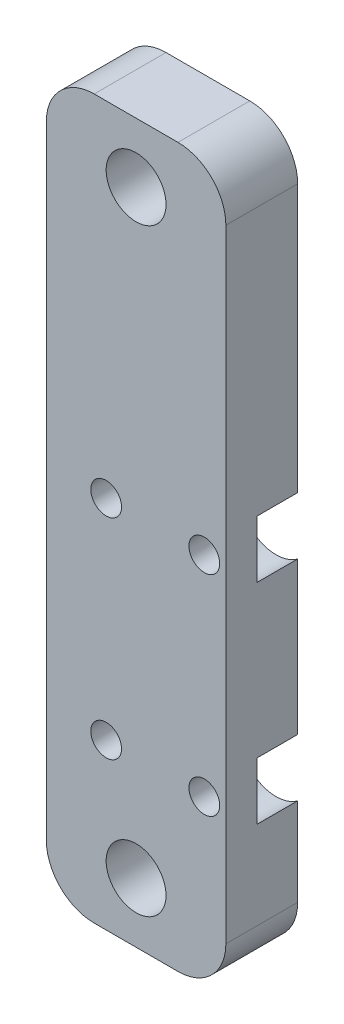
ISO-10303-21;
HEADER;
FILE_DESCRIPTION(('STEP AP214'),'2;1');
FILE_NAME('part.step','',(''),(''),'','','');
FILE_SCHEMA(('AUTOMOTIVE_DESIGN { 1 0 10303 214 1 1 1 1 }'));
ENDSEC;
DATA;
#1=APPLICATION_CONTEXT('core data for automotive mechanical design processes');
#2=APPLICATION_PROTOCOL_DEFINITION('international standard','automotive_design',2000,#1);
#3=PRODUCT_CONTEXT('',#1,'mechanical');
#4=PRODUCT('Part','Part','',(#3));
#5=PRODUCT_RELATED_PRODUCT_CATEGORY('part','',(#4));
#6=PRODUCT_DEFINITION_FORMATION('','',#4);
#7=PRODUCT_DEFINITION_CONTEXT('part definition',#1,'design');
#8=PRODUCT_DEFINITION('design','',#6,#7);
#9=PRODUCT_DEFINITION_SHAPE('','',#8);
#10=(LENGTH_UNIT() NAMED_UNIT(*) SI_UNIT(.MILLI.,.METRE.));
#11=(NAMED_UNIT(*) PLANE_ANGLE_UNIT() SI_UNIT($,.RADIAN.));
#12=(NAMED_UNIT(*) SI_UNIT($,.STERADIAN.) SOLID_ANGLE_UNIT());
#13=UNCERTAINTY_MEASURE_WITH_UNIT(LENGTH_MEASURE(1.E-05),#10,'distance_accuracy_value','');
#14=(GEOMETRIC_REPRESENTATION_CONTEXT(3) GLOBAL_UNCERTAINTY_ASSIGNED_CONTEXT((#13)) GLOBAL_UNIT_ASSIGNED_CONTEXT((#10,
#11,#12)) REPRESENTATION_CONTEXT('',''));
#15=CARTESIAN_POINT('',(0.,0.,0.));
#16=DIRECTION('',(0.,0.,1.));
#17=DIRECTION('',(1.,0.,0.));
#18=AXIS2_PLACEMENT_3D('',#15,#16,#17);
#19=CARTESIAN_POINT('',(0.,0.,7.62));
#20=DIRECTION('',(0.,0.,1.));
#21=DIRECTION('',(1.,0.,0.));
#22=AXIS2_PLACEMENT_3D('',#19,#20,#21);
#23=PLANE('',#22);
#24=CARTESIAN_POINT('',(-7.62000000000001,-7.93750000000001,7.62));
#25=DIRECTION('',(0.,0.,-1.));
#26=DIRECTION('',(-1.,0.,0.));
#27=AXIS2_PLACEMENT_3D('',#24,#25,#26);
#28=CIRCLE('',#27,1.63195000000001);
#29=CARTESIAN_POINT('',(-9.25195000000001,-7.93750000000001,7.62));
#30=VERTEX_POINT('',#29);
#31=EDGE_CURVE('E384',#30,#30,#28,.T.);
#32=ORIENTED_EDGE('',*,*,#31,.T.);
#33=EDGE_LOOP('',(#32));
#34=FACE_BOUND('',#33,.T.);
#35=CARTESIAN_POINT('',(-7.62000000000001,-30.1625,7.62));
#36=DIRECTION('',(0.,0.,-1.));
#37=DIRECTION('',(-1.,0.,0.));
#38=AXIS2_PLACEMENT_3D('',#35,#36,#37);
#39=CIRCLE('',#38,1.63195000000001);
#40=CARTESIAN_POINT('',(-9.25195000000001,-30.1625,7.62));
#41=VERTEX_POINT('',#40);
#42=EDGE_CURVE('E372',#41,#41,#39,.T.);
#43=ORIENTED_EDGE('',*,*,#42,.T.);
#44=EDGE_LOOP('',(#43));
#45=FACE_BOUND('',#44,.T.);
#46=DIRECTION('',(0.,1.,0.));
#47=VECTOR('',#46,1.);
#48=CARTESIAN_POINT('',(5.08,28.575,7.62));
#49=LINE('',#48,#47);
#50=CARTESIAN_POINT('',(5.08,-42.545,7.62));
#51=VERTEX_POINT('',#50);
#52=CARTESIAN_POINT('',(5.08,23.495,7.62));
#53=VERTEX_POINT('',#52);
#54=EDGE_CURVE('E250',#51,#53,#49,.T.);
#55=ORIENTED_EDGE('',*,*,#54,.T.);
#56=CARTESIAN_POINT('',(0.,23.495,7.62));
#57=DIRECTION('',(0.,0.,1.));
#58=DIRECTION('',(1.,0.,0.));
#59=AXIS2_PLACEMENT_3D('',#56,#57,#58);
#60=CIRCLE('',#59,5.08);
#61=CARTESIAN_POINT('',(0.,28.575,7.62));
#62=VERTEX_POINT('',#61);
#63=EDGE_CURVE('E172',#53,#62,#60,.T.);
#64=ORIENTED_EDGE('',*,*,#63,.T.);
#65=DIRECTION('',(-1.,0.,0.));
#66=VECTOR('',#65,1.);
#67=CARTESIAN_POINT('',(-13.97,28.575,7.62));
#68=LINE('',#67,#66);
#69=CARTESIAN_POINT('',(-8.89000000000001,28.575,7.62));
#70=VERTEX_POINT('',#69);
#71=EDGE_CURVE('E203',#62,#70,#68,.T.);
#72=ORIENTED_EDGE('',*,*,#71,.T.);
#73=CARTESIAN_POINT('',(-8.89000000000001,23.495,7.62));
#74=DIRECTION('',(0.,0.,1.));
#75=DIRECTION('',(1.,0.,0.));
#76=AXIS2_PLACEMENT_3D('',#73,#74,#75);
#77=CIRCLE('',#76,5.08);
#78=CARTESIAN_POINT('',(-13.97,23.495,7.62));
#79=VERTEX_POINT('',#78);
#80=EDGE_CURVE('E167',#70,#79,#77,.T.);
#81=ORIENTED_EDGE('',*,*,#80,.T.);
#82=DIRECTION('',(0.,-1.,0.));
#83=VECTOR('',#82,1.);
#84=CARTESIAN_POINT('',(-13.97,28.575,7.62));
#85=LINE('',#84,#83);
#86=CARTESIAN_POINT('',(-13.97,-42.545,7.62));
#87=VERTEX_POINT('',#86);
#88=EDGE_CURVE('E186',#79,#87,#85,.T.);
#89=ORIENTED_EDGE('',*,*,#88,.T.);
#90=CARTESIAN_POINT('',(-8.89,-42.545,7.62));
#91=DIRECTION('',(0.,0.,1.));
#92=DIRECTION('',(1.,0.,0.));
#93=AXIS2_PLACEMENT_3D('',#90,#91,#92);
#94=CIRCLE('',#93,5.08);
#95=CARTESIAN_POINT('',(-8.89,-47.625,7.62));
#96=VERTEX_POINT('',#95);
#97=EDGE_CURVE('E56',#87,#96,#94,.T.);
#98=ORIENTED_EDGE('',*,*,#97,.T.);
#99=DIRECTION('',(1.,0.,0.));
#100=VECTOR('',#99,1.);
#101=CARTESIAN_POINT('',(-13.97,-47.625,7.62));
#102=LINE('',#101,#100);
#103=CARTESIAN_POINT('',(0.,-47.625,7.62));
#104=VERTEX_POINT('',#103);
#105=EDGE_CURVE('E249',#96,#104,#102,.T.);
#106=ORIENTED_EDGE('',*,*,#105,.T.);
#107=CARTESIAN_POINT('',(0.,-42.545,7.62));
#108=DIRECTION('',(0.,0.,1.));
#109=DIRECTION('',(1.,0.,0.));
#110=AXIS2_PLACEMENT_3D('',#107,#108,#109);
#111=CIRCLE('',#110,5.08);
#112=EDGE_CURVE('E170',#104,#51,#111,.T.);
#113=ORIENTED_EDGE('',*,*,#112,.T.);
#114=EDGE_LOOP('',(#55,#64,#72,#81,#89,#98,#106,#113));
#115=FACE_BOUND('',#114,.T.);
#116=CARTESIAN_POINT('',(-4.44499999999999,-41.275,7.62));
#117=DIRECTION('',(0.,0.,1.));
#118=DIRECTION('',(1.,0.,0.));
#119=AXIS2_PLACEMENT_3D('',#116,#117,#118);
#120=CIRCLE('',#119,3.175);
#121=CARTESIAN_POINT('',(-1.26999999999999,-41.275,7.62));
#122=VERTEX_POINT('',#121);
#123=EDGE_CURVE('E200',#122,#122,#120,.T.);
#124=ORIENTED_EDGE('',*,*,#123,.F.);
#125=EDGE_LOOP('',(#124));
#126=FACE_BOUND('',#125,.T.);
#127=CARTESIAN_POINT('',(-4.445,22.225,7.62));
#128=DIRECTION('',(0.,0.,1.));
#129=DIRECTION('',(1.,0.,0.));
#130=AXIS2_PLACEMENT_3D('',#127,#128,#129);
#131=CIRCLE('',#130,3.175);
#132=CARTESIAN_POINT('',(-1.27,22.225,7.62));
#133=VERTEX_POINT('',#132);
#134=EDGE_CURVE('E214',#133,#133,#131,.T.);
#135=ORIENTED_EDGE('',*,*,#134,.F.);
#136=EDGE_LOOP('',(#135));
#137=FACE_BOUND('',#136,.T.);
#138=CARTESIAN_POINT('',(2.79399999999999,-7.93750000000001,7.62));
#139=DIRECTION('',(0.,0.,-1.));
#140=DIRECTION('',(-1.,0.,0.));
#141=AXIS2_PLACEMENT_3D('',#138,#139,#140);
#142=CIRCLE('',#141,1.63195000000001);
#143=CARTESIAN_POINT('',(1.16204999999998,-7.93750000000001,7.62));
#144=VERTEX_POINT('',#143);
#145=EDGE_CURVE('E236',#144,#144,#142,.T.);
#146=ORIENTED_EDGE('',*,*,#145,.T.);
#147=EDGE_LOOP('',(#146));
#148=FACE_BOUND('',#147,.T.);
#149=CARTESIAN_POINT('',(2.79399999999999,-30.1625,7.62));
#150=DIRECTION('',(0.,0.,-1.));
#151=DIRECTION('',(-1.,0.,0.));
#152=AXIS2_PLACEMENT_3D('',#149,#150,#151);
#153=CIRCLE('',#152,1.63195000000001);
#154=CARTESIAN_POINT('',(1.16204999999998,-30.1625,7.62));
#155=VERTEX_POINT('',#154);
#156=EDGE_CURVE('E233',#155,#155,#153,.T.);
#157=ORIENTED_EDGE('',*,*,#156,.T.);
#158=EDGE_LOOP('',(#157));
#159=FACE_BOUND('',#158,.T.);
#160=ADVANCED_FACE('F34',(#34,#45,#115,#126,#137,#148,#159),#23,.T.);
#161=CARTESIAN_POINT('',(0.,0.,0.));
#162=DIRECTION('',(0.,0.,1.));
#163=DIRECTION('',(1.,0.,0.));
#164=AXIS2_PLACEMENT_3D('',#161,#162,#163);
#165=PLANE('',#164);
#166=CARTESIAN_POINT('',(-7.62000000000001,-7.93750000000001,0.));
#167=DIRECTION('',(0.,0.,-1.));
#168=DIRECTION('',(-1.,0.,0.));
#169=AXIS2_PLACEMENT_3D('',#166,#167,#168);
#170=CIRCLE('',#169,3.81);
#171=CARTESIAN_POINT('',(-11.43,-7.93750000000001,0.));
#172=VERTEX_POINT('',#171);
#173=EDGE_CURVE('E392',#172,#172,#170,.T.);
#174=ORIENTED_EDGE('',*,*,#173,.F.);
#175=EDGE_LOOP('',(#174));
#176=FACE_BOUND('',#175,.T.);
#177=CARTESIAN_POINT('',(-7.62000000000001,-30.1625,0.));
#178=DIRECTION('',(0.,0.,-1.));
#179=DIRECTION('',(-1.,0.,0.));
#180=AXIS2_PLACEMENT_3D('',#177,#178,#179);
#181=CIRCLE('',#180,3.81);
#182=CARTESIAN_POINT('',(-11.43,-30.1625,0.));
#183=VERTEX_POINT('',#182);
#184=EDGE_CURVE('E381',#183,#183,#181,.T.);
#185=ORIENTED_EDGE('',*,*,#184,.F.);
#186=EDGE_LOOP('',(#185));
#187=FACE_BOUND('',#186,.T.);
#188=CARTESIAN_POINT('',(-4.44499999999999,-41.275,0.));
#189=DIRECTION('',(0.,0.,1.));
#190=DIRECTION('',(1.,0.,0.));
#191=AXIS2_PLACEMENT_3D('',#188,#189,#190);
#192=CIRCLE('',#191,3.175);
#193=CARTESIAN_POINT('',(-1.26999999999999,-41.275,0.));
#194=VERTEX_POINT('',#193);
#195=EDGE_CURVE('E195',#194,#194,#192,.T.);
#196=ORIENTED_EDGE('',*,*,#195,.T.);
#197=EDGE_LOOP('',(#196));
#198=FACE_BOUND('',#197,.T.);
#199=CARTESIAN_POINT('',(-4.445,22.225,0.));
#200=DIRECTION('',(0.,0.,1.));
#201=DIRECTION('',(1.,0.,0.));
#202=AXIS2_PLACEMENT_3D('',#199,#200,#201);
#203=CIRCLE('',#202,3.175);
#204=CARTESIAN_POINT('',(-1.27,22.225,0.));
#205=VERTEX_POINT('',#204);
#206=EDGE_CURVE('E211',#205,#205,#203,.T.);
#207=ORIENTED_EDGE('',*,*,#206,.T.);
#208=EDGE_LOOP('',(#207));
#209=FACE_BOUND('',#208,.T.);
#210=DIRECTION('',(-1.,0.,0.));
#211=VECTOR('',#210,1.);
#212=CARTESIAN_POINT('',(-13.97,28.575,0.));
#213=LINE('',#212,#211);
#214=CARTESIAN_POINT('',(0.,28.575,0.));
#215=VERTEX_POINT('',#214);
#216=CARTESIAN_POINT('',(-8.89000000000001,28.575,0.));
#217=VERTEX_POINT('',#216);
#218=EDGE_CURVE('E208',#215,#217,#213,.T.);
#219=ORIENTED_EDGE('',*,*,#218,.F.);
#220=CARTESIAN_POINT('',(0.,23.495,0.));
#221=DIRECTION('',(0.,0.,1.));
#222=DIRECTION('',(1.,0.,0.));
#223=AXIS2_PLACEMENT_3D('',#220,#221,#222);
#224=CIRCLE('',#223,5.08);
#225=CARTESIAN_POINT('',(5.08,23.495,0.));
#226=VERTEX_POINT('',#225);
#227=EDGE_CURVE('E160',#215,#226,#224,.F.);
#228=ORIENTED_EDGE('',*,*,#227,.T.);
#229=DIRECTION('',(0.,1.,0.));
#230=VECTOR('',#229,1.);
#231=CARTESIAN_POINT('',(5.08,28.575,0.));
#232=LINE('',#231,#230);
#233=CARTESIAN_POINT('',(5.08,-4.88950000000001,0.));
#234=VERTEX_POINT('',#233);
#235=EDGE_CURVE('E197',#234,#226,#232,.T.);
#236=ORIENTED_EDGE('',*,*,#235,.F.);
#237=CARTESIAN_POINT('',(2.79399999999999,-7.93750000000001,0.));
#238=DIRECTION('',(0.,0.,-1.));
#239=DIRECTION('',(-1.,0.,0.));
#240=AXIS2_PLACEMENT_3D('',#237,#238,#239);
#241=CIRCLE('',#240,3.81);
#242=CARTESIAN_POINT('',(5.08,-10.9855,0.));
#243=VERTEX_POINT('',#242);
#244=EDGE_CURVE('E219',#243,#234,#241,.T.);
#245=ORIENTED_EDGE('',*,*,#244,.F.);
#246=CARTESIAN_POINT('',(5.08,-27.1145,0.));
#247=VERTEX_POINT('',#246);
#248=EDGE_CURVE('E209',#247,#243,#232,.T.);
#249=ORIENTED_EDGE('',*,*,#248,.F.);
#250=CARTESIAN_POINT('',(2.79399999999999,-30.1625,0.));
#251=DIRECTION('',(0.,0.,-1.));
#252=DIRECTION('',(-1.,0.,0.));
#253=AXIS2_PLACEMENT_3D('',#250,#251,#252);
#254=CIRCLE('',#253,3.81);
#255=CARTESIAN_POINT('',(5.08,-33.2105,0.));
#256=VERTEX_POINT('',#255);
#257=EDGE_CURVE('E130',#256,#247,#254,.T.);
#258=ORIENTED_EDGE('',*,*,#257,.F.);
#259=CARTESIAN_POINT('',(5.08,-42.545,0.));
#260=VERTEX_POINT('',#259);
#261=EDGE_CURVE('E206',#260,#256,#232,.T.);
#262=ORIENTED_EDGE('',*,*,#261,.F.);
#263=CARTESIAN_POINT('',(0.,-42.545,0.));
#264=DIRECTION('',(0.,0.,1.));
#265=DIRECTION('',(1.,0.,0.));
#266=AXIS2_PLACEMENT_3D('',#263,#264,#265);
#267=CIRCLE('',#266,5.08);
#268=CARTESIAN_POINT('',(0.,-47.625,0.));
#269=VERTEX_POINT('',#268);
#270=EDGE_CURVE('E158',#260,#269,#267,.F.);
#271=ORIENTED_EDGE('',*,*,#270,.T.);
#272=DIRECTION('',(1.,0.,0.));
#273=VECTOR('',#272,1.);
#274=CARTESIAN_POINT('',(-13.97,-47.625,0.));
#275=LINE('',#274,#273);
#276=CARTESIAN_POINT('',(-8.89,-47.625,0.));
#277=VERTEX_POINT('',#276);
#278=EDGE_CURVE('E194',#277,#269,#275,.T.);
#279=ORIENTED_EDGE('',*,*,#278,.F.);
#280=CARTESIAN_POINT('',(-8.89,-42.545,0.));
#281=DIRECTION('',(0.,0.,1.));
#282=DIRECTION('',(1.,0.,0.));
#283=AXIS2_PLACEMENT_3D('',#280,#281,#282);
#284=CIRCLE('',#283,5.08);
#285=CARTESIAN_POINT('',(-13.97,-42.545,0.));
#286=VERTEX_POINT('',#285);
#287=EDGE_CURVE('E156',#277,#286,#284,.F.);
#288=ORIENTED_EDGE('',*,*,#287,.T.);
#289=DIRECTION('',(0.,-1.,0.));
#290=VECTOR('',#289,1.);
#291=CARTESIAN_POINT('',(-13.97,28.575,0.));
#292=LINE('',#291,#290);
#293=CARTESIAN_POINT('',(-13.97,23.495,0.));
#294=VERTEX_POINT('',#293);
#295=EDGE_CURVE('E184',#294,#286,#292,.T.);
#296=ORIENTED_EDGE('',*,*,#295,.F.);
#297=CARTESIAN_POINT('',(-8.89000000000001,23.495,0.));
#298=DIRECTION('',(0.,0.,1.));
#299=DIRECTION('',(1.,0.,0.));
#300=AXIS2_PLACEMENT_3D('',#297,#298,#299);
#301=CIRCLE('',#300,5.08);
#302=EDGE_CURVE('E154',#294,#217,#301,.F.);
#303=ORIENTED_EDGE('',*,*,#302,.T.);
#304=EDGE_LOOP('',(#219,#228,#236,#245,#249,#258,#262,#271,#279,#288,#296,#303));
#305=FACE_BOUND('',#304,.T.);
#306=ADVANCED_FACE('F191',(#176,#187,#198,#209,#305),#165,.F.);
#307=CARTESIAN_POINT('',(-13.97,28.575,7.62));
#308=DIRECTION('',(1.,0.,0.));
#309=DIRECTION('',(0.,1.,0.));
#310=AXIS2_PLACEMENT_3D('',#307,#308,#309);
#311=PLANE('',#310);
#312=ORIENTED_EDGE('',*,*,#295,.T.);
#313=DIRECTION('',(0.,0.,-1.));
#314=VECTOR('',#313,1.);
#315=CARTESIAN_POINT('',(-13.97,-42.545,7.62));
#316=LINE('',#315,#314);
#317=EDGE_CURVE('E11',#286,#87,#316,.F.);
#318=ORIENTED_EDGE('',*,*,#317,.T.);
#319=ORIENTED_EDGE('',*,*,#88,.F.);
#320=DIRECTION('',(0.,0.,-1.));
#321=VECTOR('',#320,1.);
#322=CARTESIAN_POINT('',(-13.97,23.495,7.62));
#323=LINE('',#322,#321);
#324=EDGE_CURVE('E42',#79,#294,#323,.T.);
#325=ORIENTED_EDGE('',*,*,#324,.T.);
#326=EDGE_LOOP('',(#312,#318,#319,#325));
#327=FACE_BOUND('',#326,.T.);
#328=ADVANCED_FACE('F183',(#327),#311,.F.);
#329=CARTESIAN_POINT('',(-13.97,-47.625,7.62));
#330=DIRECTION('',(0.,1.,0.));
#331=DIRECTION('',(0.,0.,1.));
#332=AXIS2_PLACEMENT_3D('',#329,#330,#331);
#333=PLANE('',#332);
#334=ORIENTED_EDGE('',*,*,#278,.T.);
#335=DIRECTION('',(0.,0.,-1.));
#336=VECTOR('',#335,1.);
#337=CARTESIAN_POINT('',(0.,-47.625,7.62));
#338=LINE('',#337,#336);
#339=EDGE_CURVE('E49',#269,#104,#338,.F.);
#340=ORIENTED_EDGE('',*,*,#339,.T.);
#341=ORIENTED_EDGE('',*,*,#105,.F.);
#342=DIRECTION('',(0.,0.,-1.));
#343=VECTOR('',#342,1.);
#344=CARTESIAN_POINT('',(-8.89,-47.625,7.62));
#345=LINE('',#344,#343);
#346=EDGE_CURVE('E174',#96,#277,#345,.T.);
#347=ORIENTED_EDGE('',*,*,#346,.T.);
#348=EDGE_LOOP('',(#334,#340,#341,#347));
#349=FACE_BOUND('',#348,.T.);
#350=ADVANCED_FACE('F268',(#349),#333,.F.);
#351=CARTESIAN_POINT('',(5.08,28.575,7.62));
#352=DIRECTION('',(-1.,0.,0.));
#353=DIRECTION('',(0.,-1.,0.));
#354=AXIS2_PLACEMENT_3D('',#351,#352,#353);
#355=PLANE('',#354);
#356=ORIENTED_EDGE('',*,*,#235,.T.);
#357=DIRECTION('',(0.,0.,-1.));
#358=VECTOR('',#357,1.);
#359=CARTESIAN_POINT('',(5.08,23.495,7.62));
#360=LINE('',#359,#358);
#361=EDGE_CURVE('E165',#226,#53,#360,.F.);
#362=ORIENTED_EDGE('',*,*,#361,.T.);
#363=ORIENTED_EDGE('',*,*,#54,.F.);
#364=DIRECTION('',(0.,0.,-1.));
#365=VECTOR('',#364,1.);
#366=CARTESIAN_POINT('',(5.08,-42.545,7.62));
#367=LINE('',#366,#365);
#368=EDGE_CURVE('E162',#51,#260,#367,.T.);
#369=ORIENTED_EDGE('',*,*,#368,.T.);
#370=ORIENTED_EDGE('',*,*,#261,.T.);
#371=DIRECTION('',(0.,0.,-1.));
#372=VECTOR('',#371,1.);
#373=CARTESIAN_POINT('',(5.08,-33.2105,0.));
#374=LINE('',#373,#372);
#375=CARTESIAN_POINT('',(5.08,-33.2105,4.318));
#376=VERTEX_POINT('',#375);
#377=EDGE_CURVE('E144',#256,#376,#374,.F.);
#378=ORIENTED_EDGE('',*,*,#377,.T.);
#379=DIRECTION('',(0.,1.,0.));
#380=VECTOR('',#379,1.);
#381=CARTESIAN_POINT('',(5.08,28.575,4.318));
#382=LINE('',#381,#380);
#383=CARTESIAN_POINT('',(5.08,-27.1145,4.318));
#384=VERTEX_POINT('',#383);
#385=EDGE_CURVE('E135',#376,#384,#382,.T.);
#386=ORIENTED_EDGE('',*,*,#385,.T.);
#387=DIRECTION('',(0.,0.,-1.));
#388=VECTOR('',#387,1.);
#389=CARTESIAN_POINT('',(5.08,-27.1145,0.));
#390=LINE('',#389,#388);
#391=EDGE_CURVE('E123',#384,#247,#390,.T.);
#392=ORIENTED_EDGE('',*,*,#391,.T.);
#393=ORIENTED_EDGE('',*,*,#248,.T.);
#394=DIRECTION('',(0.,0.,-1.));
#395=VECTOR('',#394,1.);
#396=CARTESIAN_POINT('',(5.08,-10.9855,0.));
#397=LINE('',#396,#395);
#398=CARTESIAN_POINT('',(5.08,-10.9855,4.318));
#399=VERTEX_POINT('',#398);
#400=EDGE_CURVE('E218',#243,#399,#397,.F.);
#401=ORIENTED_EDGE('',*,*,#400,.T.);
#402=DIRECTION('',(0.,1.,0.));
#403=VECTOR('',#402,1.);
#404=CARTESIAN_POINT('',(5.08,28.575,4.318));
#405=LINE('',#404,#403);
#406=CARTESIAN_POINT('',(5.08,-4.88950000000001,4.318));
#407=VERTEX_POINT('',#406);
#408=EDGE_CURVE('E215',#399,#407,#405,.T.);
#409=ORIENTED_EDGE('',*,*,#408,.T.);
#410=DIRECTION('',(0.,0.,-1.));
#411=VECTOR('',#410,1.);
#412=CARTESIAN_POINT('',(5.08,-4.88950000000001,0.));
#413=LINE('',#412,#411);
#414=EDGE_CURVE('E146',#407,#234,#413,.T.);
#415=ORIENTED_EDGE('',*,*,#414,.T.);
#416=EDGE_LOOP('',(#356,#362,#363,#369,#370,#378,#386,#392,#393,#401,#409,#415));
#417=FACE_BOUND('',#416,.T.);
#418=ADVANCED_FACE('F143',(#417),#355,.F.);
#419=CARTESIAN_POINT('',(-13.97,28.575,7.62));
#420=DIRECTION('',(0.,-1.,0.));
#421=DIRECTION('',(1.,0.,0.));
#422=AXIS2_PLACEMENT_3D('',#419,#420,#421);
#423=PLANE('',#422);
#424=ORIENTED_EDGE('',*,*,#71,.F.);
#425=DIRECTION('',(0.,0.,-1.));
#426=VECTOR('',#425,1.);
#427=CARTESIAN_POINT('',(0.,28.575,7.62));
#428=LINE('',#427,#426);
#429=EDGE_CURVE('E151',#62,#215,#428,.T.);
#430=ORIENTED_EDGE('',*,*,#429,.T.);
#431=ORIENTED_EDGE('',*,*,#218,.T.);
#432=DIRECTION('',(0.,0.,-1.));
#433=VECTOR('',#432,1.);
#434=CARTESIAN_POINT('',(-8.89000000000001,28.575,7.62));
#435=LINE('',#434,#433);
#436=EDGE_CURVE('E134',#217,#70,#435,.F.);
#437=ORIENTED_EDGE('',*,*,#436,.T.);
#438=EDGE_LOOP('',(#424,#430,#431,#437));
#439=FACE_BOUND('',#438,.T.);
#440=ADVANCED_FACE('F260',(#439),#423,.F.);
#441=CARTESIAN_POINT('',(-4.44499999999999,-41.275,7.62));
#442=DIRECTION('',(0.,0.,1.));
#443=DIRECTION('',(1.,0.,0.));
#444=AXIS2_PLACEMENT_3D('',#441,#442,#443);
#445=CYLINDRICAL_SURFACE('',#444,3.175);
#446=ORIENTED_EDGE('',*,*,#123,.T.);
#447=EDGE_LOOP('',(#446));
#448=FACE_BOUND('',#447,.T.);
#449=ORIENTED_EDGE('',*,*,#195,.F.);
#450=EDGE_LOOP('',(#449));
#451=FACE_BOUND('',#450,.T.);
#452=ADVANCED_FACE('F289',(#448,#451),#445,.F.);
#453=CARTESIAN_POINT('',(-4.445,22.225,7.62));
#454=DIRECTION('',(0.,0.,1.));
#455=DIRECTION('',(1.,0.,0.));
#456=AXIS2_PLACEMENT_3D('',#453,#454,#455);
#457=CYLINDRICAL_SURFACE('',#456,3.175);
#458=ORIENTED_EDGE('',*,*,#134,.T.);
#459=EDGE_LOOP('',(#458));
#460=FACE_BOUND('',#459,.T.);
#461=ORIENTED_EDGE('',*,*,#206,.F.);
#462=EDGE_LOOP('',(#461));
#463=FACE_BOUND('',#462,.T.);
#464=ADVANCED_FACE('F345',(#460,#463),#457,.F.);
#465=CARTESIAN_POINT('',(2.79399999999999,-7.93750000000001,0.));
#466=DIRECTION('',(0.,0.,-1.));
#467=DIRECTION('',(-1.,0.,0.));
#468=AXIS2_PLACEMENT_3D('',#465,#466,#467);
#469=CYLINDRICAL_SURFACE('',#468,3.81);
#470=CARTESIAN_POINT('',(2.79399999999999,-7.93750000000001,4.318));
#471=DIRECTION('',(0.,0.,-1.));
#472=DIRECTION('',(-1.,0.,0.));
#473=AXIS2_PLACEMENT_3D('',#470,#471,#472);
#474=CIRCLE('',#473,3.81);
#475=EDGE_CURVE('E230',#399,#407,#474,.T.);
#476=ORIENTED_EDGE('',*,*,#475,.F.);
#477=ORIENTED_EDGE('',*,*,#400,.F.);
#478=ORIENTED_EDGE('',*,*,#244,.T.);
#479=ORIENTED_EDGE('',*,*,#414,.F.);
#480=EDGE_LOOP('',(#476,#477,#478,#479));
#481=FACE_BOUND('',#480,.T.);
#482=ADVANCED_FACE('F229',(#481),#469,.F.);
#483=CARTESIAN_POINT('',(4.42594999999999,-7.93750000000001,4.318));
#484=DIRECTION('',(0.,0.,1.));
#485=DIRECTION('',(1.,0.,0.));
#486=AXIS2_PLACEMENT_3D('',#483,#484,#485);
#487=PLANE('',#486);
#488=CARTESIAN_POINT('',(2.79399999999999,-7.93750000000001,4.318));
#489=DIRECTION('',(0.,0.,-1.));
#490=DIRECTION('',(-1.,0.,0.));
#491=AXIS2_PLACEMENT_3D('',#488,#489,#490);
#492=CIRCLE('',#491,1.63195);
#493=CARTESIAN_POINT('',(1.16205,-7.93750000000001,4.318));
#494=VERTEX_POINT('',#493);
#495=EDGE_CURVE('E232',#494,#494,#492,.T.);
#496=ORIENTED_EDGE('',*,*,#495,.F.);
#497=EDGE_LOOP('',(#496));
#498=FACE_BOUND('',#497,.T.);
#499=ORIENTED_EDGE('',*,*,#475,.T.);
#500=ORIENTED_EDGE('',*,*,#408,.F.);
#501=EDGE_LOOP('',(#499,#500));
#502=FACE_BOUND('',#501,.T.);
#503=ADVANCED_FACE('F344',(#498,#502),#487,.F.);
#504=CARTESIAN_POINT('',(2.79399999999999,-7.93750000000001,0.));
#505=DIRECTION('',(0.,0.,-1.));
#506=DIRECTION('',(-1.,0.,0.));
#507=AXIS2_PLACEMENT_3D('',#504,#505,#506);
#508=CYLINDRICAL_SURFACE('',#507,1.63195);
#509=ORIENTED_EDGE('',*,*,#145,.F.);
#510=EDGE_LOOP('',(#509));
#511=FACE_BOUND('',#510,.T.);
#512=ORIENTED_EDGE('',*,*,#495,.T.);
#513=EDGE_LOOP('',(#512));
#514=FACE_BOUND('',#513,.T.);
#515=ADVANCED_FACE('F337',(#511,#514),#508,.F.);
#516=CARTESIAN_POINT('',(4.42594999999999,-30.1625,4.318));
#517=DIRECTION('',(0.,0.,1.));
#518=DIRECTION('',(1.,0.,0.));
#519=AXIS2_PLACEMENT_3D('',#516,#517,#518);
#520=PLANE('',#519);
#521=CARTESIAN_POINT('',(2.79399999999999,-30.1625,4.318));
#522=DIRECTION('',(0.,0.,-1.));
#523=DIRECTION('',(-1.,0.,0.));
#524=AXIS2_PLACEMENT_3D('',#521,#522,#523);
#525=CIRCLE('',#524,1.63195);
#526=CARTESIAN_POINT('',(1.16205,-30.1625,4.318));
#527=VERTEX_POINT('',#526);
#528=EDGE_CURVE('E140',#527,#527,#525,.T.);
#529=ORIENTED_EDGE('',*,*,#528,.F.);
#530=EDGE_LOOP('',(#529));
#531=FACE_BOUND('',#530,.T.);
#532=CARTESIAN_POINT('',(2.79399999999999,-30.1625,4.318));
#533=DIRECTION('',(0.,0.,-1.));
#534=DIRECTION('',(-1.,0.,0.));
#535=AXIS2_PLACEMENT_3D('',#532,#533,#534);
#536=CIRCLE('',#535,3.81);
#537=EDGE_CURVE('E127',#376,#384,#536,.T.);
#538=ORIENTED_EDGE('',*,*,#537,.T.);
#539=ORIENTED_EDGE('',*,*,#385,.F.);
#540=EDGE_LOOP('',(#538,#539));
#541=FACE_BOUND('',#540,.T.);
#542=ADVANCED_FACE('F138',(#531,#541),#520,.F.);
#543=CARTESIAN_POINT('',(2.79399999999999,-30.1625,0.));
#544=DIRECTION('',(0.,0.,-1.));
#545=DIRECTION('',(-1.,0.,0.));
#546=AXIS2_PLACEMENT_3D('',#543,#544,#545);
#547=CYLINDRICAL_SURFACE('',#546,3.81);
#548=ORIENTED_EDGE('',*,*,#537,.F.);
#549=ORIENTED_EDGE('',*,*,#377,.F.);
#550=ORIENTED_EDGE('',*,*,#257,.T.);
#551=ORIENTED_EDGE('',*,*,#391,.F.);
#552=EDGE_LOOP('',(#548,#549,#550,#551));
#553=FACE_BOUND('',#552,.T.);
#554=ADVANCED_FACE('F125',(#553),#547,.F.);
#555=CARTESIAN_POINT('',(2.79399999999999,-30.1625,0.));
#556=DIRECTION('',(0.,0.,-1.));
#557=DIRECTION('',(-1.,0.,0.));
#558=AXIS2_PLACEMENT_3D('',#555,#556,#557);
#559=CYLINDRICAL_SURFACE('',#558,1.63195);
#560=ORIENTED_EDGE('',*,*,#156,.F.);
#561=EDGE_LOOP('',(#560));
#562=FACE_BOUND('',#561,.T.);
#563=ORIENTED_EDGE('',*,*,#528,.T.);
#564=EDGE_LOOP('',(#563));
#565=FACE_BOUND('',#564,.T.);
#566=ADVANCED_FACE('F331',(#562,#565),#559,.F.);
#567=CARTESIAN_POINT('',(-7.62000000000001,-30.1625,0.));
#568=DIRECTION('',(0.,0.,-1.));
#569=DIRECTION('',(-1.,0.,0.));
#570=AXIS2_PLACEMENT_3D('',#567,#568,#569);
#571=CYLINDRICAL_SURFACE('',#570,1.63195);
#572=ORIENTED_EDGE('',*,*,#42,.F.);
#573=EDGE_LOOP('',(#572));
#574=FACE_BOUND('',#573,.T.);
#575=CARTESIAN_POINT('',(-7.62000000000001,-30.1625,4.318));
#576=DIRECTION('',(0.,0.,-1.));
#577=DIRECTION('',(-1.,0.,0.));
#578=AXIS2_PLACEMENT_3D('',#575,#576,#577);
#579=CIRCLE('',#578,1.63195);
#580=CARTESIAN_POINT('',(-9.25195000000001,-30.1625,4.318));
#581=VERTEX_POINT('',#580);
#582=EDGE_CURVE('E375',#581,#581,#579,.T.);
#583=ORIENTED_EDGE('',*,*,#582,.T.);
#584=EDGE_LOOP('',(#583));
#585=FACE_BOUND('',#584,.T.);
#586=ADVANCED_FACE('F327',(#574,#585),#571,.F.);
#587=CARTESIAN_POINT('',(-5.98805000000001,-30.1625,4.318));
#588=DIRECTION('',(0.,0.,1.));
#589=DIRECTION('',(1.,0.,0.));
#590=AXIS2_PLACEMENT_3D('',#587,#588,#589);
#591=PLANE('',#590);
#592=ORIENTED_EDGE('',*,*,#582,.F.);
#593=EDGE_LOOP('',(#592));
#594=FACE_BOUND('',#593,.T.);
#595=CARTESIAN_POINT('',(-7.62000000000001,-30.1625,4.318));
#596=DIRECTION('',(0.,0.,-1.));
#597=DIRECTION('',(-1.,0.,0.));
#598=AXIS2_PLACEMENT_3D('',#595,#596,#597);
#599=CIRCLE('',#598,3.81);
#600=CARTESIAN_POINT('',(-11.43,-30.1625,4.318));
#601=VERTEX_POINT('',#600);
#602=EDGE_CURVE('E378',#601,#601,#599,.T.);
#603=ORIENTED_EDGE('',*,*,#602,.T.);
#604=EDGE_LOOP('',(#603));
#605=FACE_BOUND('',#604,.T.);
#606=ADVANCED_FACE('F323',(#594,#605),#591,.F.);
#607=CARTESIAN_POINT('',(-7.62000000000001,-30.1625,0.));
#608=DIRECTION('',(0.,0.,-1.));
#609=DIRECTION('',(-1.,0.,0.));
#610=AXIS2_PLACEMENT_3D('',#607,#608,#609);
#611=CYLINDRICAL_SURFACE('',#610,3.81);
#612=ORIENTED_EDGE('',*,*,#602,.F.);
#613=EDGE_LOOP('',(#612));
#614=FACE_BOUND('',#613,.T.);
#615=ORIENTED_EDGE('',*,*,#184,.T.);
#616=EDGE_LOOP('',(#615));
#617=FACE_BOUND('',#616,.T.);
#618=ADVANCED_FACE('F319',(#614,#617),#611,.F.);
#619=CARTESIAN_POINT('',(-7.62000000000001,-7.93750000000001,0.));
#620=DIRECTION('',(0.,0.,-1.));
#621=DIRECTION('',(-1.,0.,0.));
#622=AXIS2_PLACEMENT_3D('',#619,#620,#621);
#623=CYLINDRICAL_SURFACE('',#622,1.63195);
#624=ORIENTED_EDGE('',*,*,#31,.F.);
#625=EDGE_LOOP('',(#624));
#626=FACE_BOUND('',#625,.T.);
#627=CARTESIAN_POINT('',(-7.62000000000001,-7.93750000000001,4.318));
#628=DIRECTION('',(0.,0.,-1.));
#629=DIRECTION('',(-1.,0.,0.));
#630=AXIS2_PLACEMENT_3D('',#627,#628,#629);
#631=CIRCLE('',#630,1.63195);
#632=CARTESIAN_POINT('',(-9.25195000000001,-7.93750000000001,4.318));
#633=VERTEX_POINT('',#632);
#634=EDGE_CURVE('E386',#633,#633,#631,.T.);
#635=ORIENTED_EDGE('',*,*,#634,.T.);
#636=EDGE_LOOP('',(#635));
#637=FACE_BOUND('',#636,.T.);
#638=ADVANCED_FACE('F311',(#626,#637),#623,.F.);
#639=CARTESIAN_POINT('',(-5.98805000000001,-7.93750000000001,4.318));
#640=DIRECTION('',(0.,0.,1.));
#641=DIRECTION('',(1.,0.,0.));
#642=AXIS2_PLACEMENT_3D('',#639,#640,#641);
#643=PLANE('',#642);
#644=ORIENTED_EDGE('',*,*,#634,.F.);
#645=EDGE_LOOP('',(#644));
#646=FACE_BOUND('',#645,.T.);
#647=CARTESIAN_POINT('',(-7.62000000000001,-7.93750000000001,4.318));
#648=DIRECTION('',(0.,0.,-1.));
#649=DIRECTION('',(-1.,0.,0.));
#650=AXIS2_PLACEMENT_3D('',#647,#648,#649);
#651=CIRCLE('',#650,3.81);
#652=CARTESIAN_POINT('',(-11.43,-7.93750000000001,4.318));
#653=VERTEX_POINT('',#652);
#654=EDGE_CURVE('E389',#653,#653,#651,.T.);
#655=ORIENTED_EDGE('',*,*,#654,.T.);
#656=EDGE_LOOP('',(#655));
#657=FACE_BOUND('',#656,.T.);
#658=ADVANCED_FACE('F305',(#646,#657),#643,.F.);
#659=CARTESIAN_POINT('',(-7.62000000000001,-7.93750000000001,0.));
#660=DIRECTION('',(0.,0.,-1.));
#661=DIRECTION('',(-1.,0.,0.));
#662=AXIS2_PLACEMENT_3D('',#659,#660,#661);
#663=CYLINDRICAL_SURFACE('',#662,3.81);
#664=ORIENTED_EDGE('',*,*,#654,.F.);
#665=EDGE_LOOP('',(#664));
#666=FACE_BOUND('',#665,.T.);
#667=ORIENTED_EDGE('',*,*,#173,.T.);
#668=EDGE_LOOP('',(#667));
#669=FACE_BOUND('',#668,.T.);
#670=ADVANCED_FACE('F301',(#666,#669),#663,.F.);
#671=CARTESIAN_POINT('',(0.,23.495,7.62));
#672=DIRECTION('',(0.,0.,-1.));
#673=DIRECTION('',(-1.,0.,0.));
#674=AXIS2_PLACEMENT_3D('',#671,#672,#673);
#675=CYLINDRICAL_SURFACE('',#674,5.08);
#676=ORIENTED_EDGE('',*,*,#63,.F.);
#677=ORIENTED_EDGE('',*,*,#361,.F.);
#678=ORIENTED_EDGE('',*,*,#227,.F.);
#679=ORIENTED_EDGE('',*,*,#429,.F.);
#680=EDGE_LOOP('',(#676,#677,#678,#679));
#681=FACE_BOUND('',#680,.T.);
#682=ADVANCED_FACE('F262',(#681),#675,.T.);
#683=CARTESIAN_POINT('',(0.,-42.545,7.62));
#684=DIRECTION('',(0.,0.,-1.));
#685=DIRECTION('',(-1.,0.,0.));
#686=AXIS2_PLACEMENT_3D('',#683,#684,#685);
#687=CYLINDRICAL_SURFACE('',#686,5.08);
#688=ORIENTED_EDGE('',*,*,#112,.F.);
#689=ORIENTED_EDGE('',*,*,#339,.F.);
#690=ORIENTED_EDGE('',*,*,#270,.F.);
#691=ORIENTED_EDGE('',*,*,#368,.F.);
#692=EDGE_LOOP('',(#688,#689,#690,#691));
#693=FACE_BOUND('',#692,.T.);
#694=ADVANCED_FACE('F267',(#693),#687,.T.);
#695=CARTESIAN_POINT('',(-8.89,-42.545,7.62));
#696=DIRECTION('',(0.,0.,-1.));
#697=DIRECTION('',(-1.,0.,0.));
#698=AXIS2_PLACEMENT_3D('',#695,#696,#697);
#699=CYLINDRICAL_SURFACE('',#698,5.08);
#700=ORIENTED_EDGE('',*,*,#97,.F.);
#701=ORIENTED_EDGE('',*,*,#317,.F.);
#702=ORIENTED_EDGE('',*,*,#287,.F.);
#703=ORIENTED_EDGE('',*,*,#346,.F.);
#704=EDGE_LOOP('',(#700,#701,#702,#703));
#705=FACE_BOUND('',#704,.T.);
#706=ADVANCED_FACE('F271',(#705),#699,.T.);
#707=CARTESIAN_POINT('',(-8.89000000000001,23.495,7.62));
#708=DIRECTION('',(0.,0.,-1.));
#709=DIRECTION('',(-1.,0.,0.));
#710=AXIS2_PLACEMENT_3D('',#707,#708,#709);
#711=CYLINDRICAL_SURFACE('',#710,5.08);
#712=ORIENTED_EDGE('',*,*,#80,.F.);
#713=ORIENTED_EDGE('',*,*,#436,.F.);
#714=ORIENTED_EDGE('',*,*,#302,.F.);
#715=ORIENTED_EDGE('',*,*,#324,.F.);
#716=EDGE_LOOP('',(#712,#713,#714,#715));
#717=FACE_BOUND('',#716,.T.);
#718=ADVANCED_FACE('F36',(#717),#711,.T.);
#719=CLOSED_SHELL('',(#160,#306,#328,#350,#418,#440,#452,#464,#482,#503,#515,#542,#554,#566,
#586,#606,#618,#638,#658,#670,#682,#694,#706,#718));
#720=MANIFOLD_SOLID_BREP('B2',#719);
#721=ADVANCED_BREP_SHAPE_REPRESENTATION('',(#18,#720),#14);
#722=SHAPE_DEFINITION_REPRESENTATION(#9,#721);
ENDSEC;
END-ISO-10303-21;
